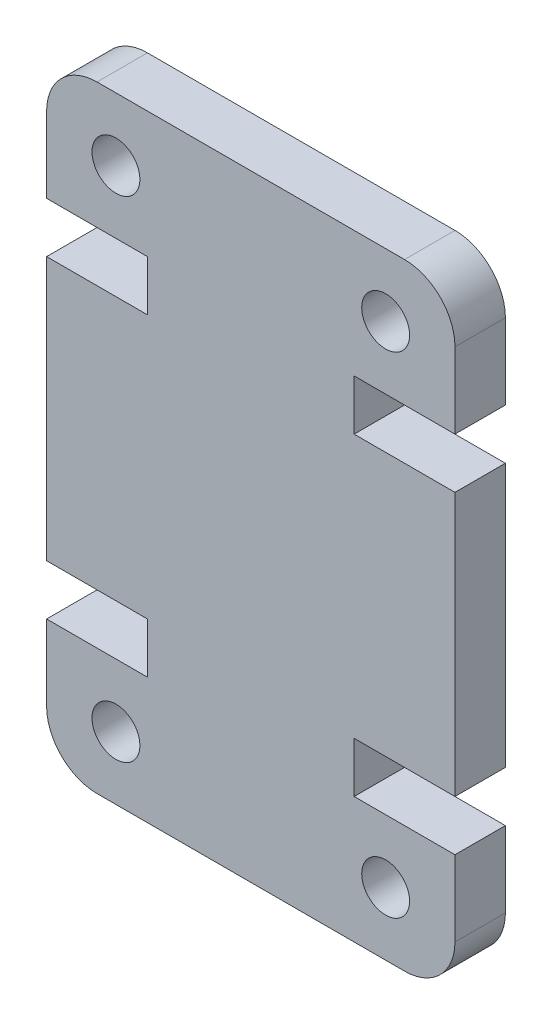
ISO-10303-21;
HEADER;
FILE_DESCRIPTION(('STEP AP214'),'2;1');
FILE_NAME('part.step','',(''),(''),'','','');
FILE_SCHEMA(('AUTOMOTIVE_DESIGN { 1 0 10303 214 1 1 1 1 }'));
ENDSEC;
DATA;
#1=APPLICATION_CONTEXT('core data for automotive mechanical design processes');
#2=APPLICATION_PROTOCOL_DEFINITION('international standard','automotive_design',2000,#1);
#3=PRODUCT_CONTEXT('',#1,'mechanical');
#4=PRODUCT('Part','Part','',(#3));
#5=PRODUCT_RELATED_PRODUCT_CATEGORY('part','',(#4));
#6=PRODUCT_DEFINITION_FORMATION('','',#4);
#7=PRODUCT_DEFINITION_CONTEXT('part definition',#1,'design');
#8=PRODUCT_DEFINITION('design','',#6,#7);
#9=PRODUCT_DEFINITION_SHAPE('','',#8);
#10=(LENGTH_UNIT() NAMED_UNIT(*) SI_UNIT(.MILLI.,.METRE.));
#11=(NAMED_UNIT(*) PLANE_ANGLE_UNIT() SI_UNIT($,.RADIAN.));
#12=(NAMED_UNIT(*) SI_UNIT($,.STERADIAN.) SOLID_ANGLE_UNIT());
#13=UNCERTAINTY_MEASURE_WITH_UNIT(LENGTH_MEASURE(1.E-05),#10,'distance_accuracy_value','');
#14=(GEOMETRIC_REPRESENTATION_CONTEXT(3) GLOBAL_UNCERTAINTY_ASSIGNED_CONTEXT((#13)) GLOBAL_UNIT_ASSIGNED_CONTEXT((#10,
#11,#12)) REPRESENTATION_CONTEXT('',''));
#15=CARTESIAN_POINT('',(0.,0.,0.));
#16=DIRECTION('',(0.,0.,1.));
#17=DIRECTION('',(1.,0.,0.));
#18=AXIS2_PLACEMENT_3D('',#15,#16,#17);
#19=CARTESIAN_POINT('',(14.2,2.,4.));
#20=DIRECTION('',(0.,0.,-1.));
#21=DIRECTION('',(-1.,0.,0.));
#22=AXIS2_PLACEMENT_3D('',#19,#20,#21);
#23=CYLINDRICAL_SURFACE('',#22,2.);
#24=CARTESIAN_POINT('',(14.2,2.,2.));
#25=DIRECTION('',(0.,0.,-1.));
#26=DIRECTION('',(-1.,0.,0.));
#27=AXIS2_PLACEMENT_3D('',#24,#25,#26);
#28=CIRCLE('',#27,2.);
#29=CARTESIAN_POINT('',(16.2,2.00000000000001,2.));
#30=VERTEX_POINT('',#29);
#31=CARTESIAN_POINT('',(14.2,0.,2.));
#32=VERTEX_POINT('',#31);
#33=EDGE_CURVE('E48',#30,#32,#28,.T.);
#34=ORIENTED_EDGE('',*,*,#33,.F.);
#35=DIRECTION('',(0.,0.,-1.));
#36=VECTOR('',#35,1.);
#37=CARTESIAN_POINT('',(16.2,2.,4.));
#38=LINE('',#37,#36);
#39=CARTESIAN_POINT('',(16.2,2.,4.));
#40=VERTEX_POINT('',#39);
#41=EDGE_CURVE('E11',#40,#30,#38,.T.);
#42=ORIENTED_EDGE('',*,*,#41,.F.);
#43=CARTESIAN_POINT('',(14.2,2.,4.));
#44=DIRECTION('',(0.,0.,1.));
#45=DIRECTION('',(-1.,0.,0.));
#46=AXIS2_PLACEMENT_3D('',#43,#44,#45);
#47=CIRCLE('',#46,2.);
#48=CARTESIAN_POINT('',(14.2,0.,4.));
#49=VERTEX_POINT('',#48);
#50=EDGE_CURVE('E353',#49,#40,#47,.T.);
#51=ORIENTED_EDGE('',*,*,#50,.F.);
#52=DIRECTION('',(0.,0.,-1.));
#53=VECTOR('',#52,1.);
#54=CARTESIAN_POINT('',(14.2,0.,4.));
#55=LINE('',#54,#53);
#56=EDGE_CURVE('E214',#49,#32,#55,.T.);
#57=ORIENTED_EDGE('',*,*,#56,.T.);
#58=EDGE_LOOP('',(#34,#42,#51,#57));
#59=FACE_BOUND('',#58,.T.);
#60=ADVANCED_FACE('F33',(#59),#23,.T.);
#61=CARTESIAN_POINT('',(16.2,5.00000000000014,4.));
#62=DIRECTION('',(-1.,0.,0.));
#63=DIRECTION('',(0.,0.,1.));
#64=AXIS2_PLACEMENT_3D('',#61,#62,#63);
#65=PLANE('',#64);
#66=DIRECTION('',(0.,-1.,0.));
#67=VECTOR('',#66,1.);
#68=CARTESIAN_POINT('',(16.2,24.45,2.));
#69=LINE('',#68,#67);
#70=CARTESIAN_POINT('',(16.2,5.00000000000014,2.));
#71=VERTEX_POINT('',#70);
#72=EDGE_CURVE('E290',#71,#30,#69,.T.);
#73=ORIENTED_EDGE('',*,*,#72,.F.);
#74=DIRECTION('',(0.,0.,-1.));
#75=VECTOR('',#74,1.);
#76=CARTESIAN_POINT('',(16.2,5.00000000000014,4.));
#77=LINE('',#76,#75);
#78=CARTESIAN_POINT('',(16.2,5.00000000000014,4.));
#79=VERTEX_POINT('',#78);
#80=EDGE_CURVE('E41',#79,#71,#77,.T.);
#81=ORIENTED_EDGE('',*,*,#80,.F.);
#82=DIRECTION('',(0.,1.,0.));
#83=VECTOR('',#82,1.);
#84=CARTESIAN_POINT('',(16.2,5.00000000000014,4.));
#85=LINE('',#84,#83);
#86=EDGE_CURVE('E289',#40,#79,#85,.T.);
#87=ORIENTED_EDGE('',*,*,#86,.F.);
#88=ORIENTED_EDGE('',*,*,#41,.T.);
#89=EDGE_LOOP('',(#73,#81,#87,#88));
#90=FACE_BOUND('',#89,.T.);
#91=ADVANCED_FACE('F288',(#90),#65,.F.);
#92=CARTESIAN_POINT('',(12.2,5.00000000000014,4.));
#93=DIRECTION('',(0.,-1.,0.));
#94=DIRECTION('',(0.,0.,-1.));
#95=AXIS2_PLACEMENT_3D('',#92,#93,#94);
#96=PLANE('',#95);
#97=DIRECTION('',(1.,0.,0.));
#98=VECTOR('',#97,1.);
#99=CARTESIAN_POINT('',(12.2,5.00000000000014,2.));
#100=LINE('',#99,#98);
#101=CARTESIAN_POINT('',(12.2,5.00000000000014,2.));
#102=VERTEX_POINT('',#101);
#103=EDGE_CURVE('E284',#102,#71,#100,.T.);
#104=ORIENTED_EDGE('',*,*,#103,.F.);
#105=DIRECTION('',(0.,0.,-1.));
#106=VECTOR('',#105,1.);
#107=CARTESIAN_POINT('',(12.2,5.00000000000014,4.));
#108=LINE('',#107,#106);
#109=CARTESIAN_POINT('',(12.2,5.00000000000014,4.));
#110=VERTEX_POINT('',#109);
#111=EDGE_CURVE('E274',#110,#102,#108,.T.);
#112=ORIENTED_EDGE('',*,*,#111,.F.);
#113=DIRECTION('',(-1.,0.,0.));
#114=VECTOR('',#113,1.);
#115=CARTESIAN_POINT('',(12.2,5.00000000000014,4.));
#116=LINE('',#115,#114);
#117=EDGE_CURVE('E285',#79,#110,#116,.T.);
#118=ORIENTED_EDGE('',*,*,#117,.F.);
#119=ORIENTED_EDGE('',*,*,#80,.T.);
#120=EDGE_LOOP('',(#104,#112,#118,#119));
#121=FACE_BOUND('',#120,.T.);
#122=ADVANCED_FACE('F282',(#121),#96,.F.);
#123=CARTESIAN_POINT('',(12.2,7.00000000000014,4.));
#124=DIRECTION('',(-1.,0.,0.));
#125=DIRECTION('',(0.,0.,1.));
#126=AXIS2_PLACEMENT_3D('',#123,#124,#125);
#127=PLANE('',#126);
#128=DIRECTION('',(0.,-1.,0.));
#129=VECTOR('',#128,1.);
#130=CARTESIAN_POINT('',(12.2,7.00000000000014,2.));
#131=LINE('',#130,#129);
#132=CARTESIAN_POINT('',(12.2,7.00000000000014,2.));
#133=VERTEX_POINT('',#132);
#134=EDGE_CURVE('E337',#133,#102,#131,.T.);
#135=ORIENTED_EDGE('',*,*,#134,.F.);
#136=DIRECTION('',(0.,0.,-1.));
#137=VECTOR('',#136,1.);
#138=CARTESIAN_POINT('',(12.2,7.00000000000014,4.));
#139=LINE('',#138,#137);
#140=CARTESIAN_POINT('',(12.2,7.00000000000014,4.));
#141=VERTEX_POINT('',#140);
#142=EDGE_CURVE('E271',#141,#133,#139,.T.);
#143=ORIENTED_EDGE('',*,*,#142,.F.);
#144=DIRECTION('',(0.,1.,0.));
#145=VECTOR('',#144,1.);
#146=CARTESIAN_POINT('',(12.2,7.00000000000014,4.));
#147=LINE('',#146,#145);
#148=EDGE_CURVE('E357',#110,#141,#147,.T.);
#149=ORIENTED_EDGE('',*,*,#148,.F.);
#150=ORIENTED_EDGE('',*,*,#111,.T.);
#151=EDGE_LOOP('',(#135,#143,#149,#150));
#152=FACE_BOUND('',#151,.T.);
#153=ADVANCED_FACE('F460',(#152),#127,.F.);
#154=CARTESIAN_POINT('',(16.2,7.00000000000014,4.));
#155=DIRECTION('',(0.,1.,0.));
#156=DIRECTION('',(-1.,0.,0.));
#157=AXIS2_PLACEMENT_3D('',#154,#155,#156);
#158=PLANE('',#157);
#159=DIRECTION('',(-1.,0.,0.));
#160=VECTOR('',#159,1.);
#161=CARTESIAN_POINT('',(16.2,7.00000000000014,2.));
#162=LINE('',#161,#160);
#163=CARTESIAN_POINT('',(16.2,7.00000000000014,2.));
#164=VERTEX_POINT('',#163);
#165=EDGE_CURVE('E335',#164,#133,#162,.T.);
#166=ORIENTED_EDGE('',*,*,#165,.F.);
#167=DIRECTION('',(0.,0.,-1.));
#168=VECTOR('',#167,1.);
#169=CARTESIAN_POINT('',(16.2,7.00000000000014,4.));
#170=LINE('',#169,#168);
#171=CARTESIAN_POINT('',(16.2,7.00000000000014,4.));
#172=VERTEX_POINT('',#171);
#173=EDGE_CURVE('E268',#172,#164,#170,.T.);
#174=ORIENTED_EDGE('',*,*,#173,.F.);
#175=DIRECTION('',(1.,0.,0.));
#176=VECTOR('',#175,1.);
#177=CARTESIAN_POINT('',(16.2,7.00000000000014,4.));
#178=LINE('',#177,#176);
#179=EDGE_CURVE('E359',#141,#172,#178,.T.);
#180=ORIENTED_EDGE('',*,*,#179,.F.);
#181=ORIENTED_EDGE('',*,*,#142,.T.);
#182=EDGE_LOOP('',(#166,#174,#180,#181));
#183=FACE_BOUND('',#182,.T.);
#184=ADVANCED_FACE('F456',(#183),#158,.F.);
#185=CARTESIAN_POINT('',(16.2,17.4499999999999,4.));
#186=DIRECTION('',(-1.,0.,0.));
#187=DIRECTION('',(0.,0.,1.));
#188=AXIS2_PLACEMENT_3D('',#185,#186,#187);
#189=PLANE('',#188);
#190=CARTESIAN_POINT('',(16.2,17.4499999999999,2.));
#191=VERTEX_POINT('',#190);
#192=EDGE_CURVE('E292',#191,#164,#69,.T.);
#193=ORIENTED_EDGE('',*,*,#192,.F.);
#194=DIRECTION('',(0.,0.,-1.));
#195=VECTOR('',#194,1.);
#196=CARTESIAN_POINT('',(16.2,17.4499999999999,4.));
#197=LINE('',#196,#195);
#198=CARTESIAN_POINT('',(16.2,17.4499999999999,4.));
#199=VERTEX_POINT('',#198);
#200=EDGE_CURVE('E265',#199,#191,#197,.T.);
#201=ORIENTED_EDGE('',*,*,#200,.F.);
#202=DIRECTION('',(0.,1.,0.));
#203=VECTOR('',#202,1.);
#204=CARTESIAN_POINT('',(16.2,17.4499999999999,4.));
#205=LINE('',#204,#203);
#206=EDGE_CURVE('E361',#172,#199,#205,.T.);
#207=ORIENTED_EDGE('',*,*,#206,.F.);
#208=ORIENTED_EDGE('',*,*,#173,.T.);
#209=EDGE_LOOP('',(#193,#201,#207,#208));
#210=FACE_BOUND('',#209,.T.);
#211=ADVANCED_FACE('F451',(#210),#189,.F.);
#212=CARTESIAN_POINT('',(16.2,17.4499999999999,4.));
#213=DIRECTION('',(0.,-1.,0.));
#214=DIRECTION('',(1.,0.,0.));
#215=AXIS2_PLACEMENT_3D('',#212,#213,#214);
#216=PLANE('',#215);
#217=DIRECTION('',(1.,0.,0.));
#218=VECTOR('',#217,1.);
#219=CARTESIAN_POINT('',(16.2,17.4499999999999,2.));
#220=LINE('',#219,#218);
#221=CARTESIAN_POINT('',(12.2,17.4499999999999,2.));
#222=VERTEX_POINT('',#221);
#223=EDGE_CURVE('E333',#222,#191,#220,.T.);
#224=ORIENTED_EDGE('',*,*,#223,.F.);
#225=DIRECTION('',(0.,0.,-1.));
#226=VECTOR('',#225,1.);
#227=CARTESIAN_POINT('',(12.2,17.4499999999999,4.));
#228=LINE('',#227,#226);
#229=CARTESIAN_POINT('',(12.2,17.4499999999999,4.));
#230=VERTEX_POINT('',#229);
#231=EDGE_CURVE('E262',#230,#222,#228,.T.);
#232=ORIENTED_EDGE('',*,*,#231,.F.);
#233=DIRECTION('',(-1.,0.,0.));
#234=VECTOR('',#233,1.);
#235=CARTESIAN_POINT('',(16.2,17.4499999999999,4.));
#236=LINE('',#235,#234);
#237=EDGE_CURVE('E363',#199,#230,#236,.T.);
#238=ORIENTED_EDGE('',*,*,#237,.F.);
#239=ORIENTED_EDGE('',*,*,#200,.T.);
#240=EDGE_LOOP('',(#224,#232,#238,#239));
#241=FACE_BOUND('',#240,.T.);
#242=ADVANCED_FACE('F446',(#241),#216,.F.);
#243=CARTESIAN_POINT('',(12.2,17.4499999999999,4.));
#244=DIRECTION('',(-1.,0.,0.));
#245=DIRECTION('',(0.,0.,1.));
#246=AXIS2_PLACEMENT_3D('',#243,#244,#245);
#247=PLANE('',#246);
#248=DIRECTION('',(0.,-1.,0.));
#249=VECTOR('',#248,1.);
#250=CARTESIAN_POINT('',(12.2,17.4499999999999,2.));
#251=LINE('',#250,#249);
#252=CARTESIAN_POINT('',(12.2,19.4499999999999,2.));
#253=VERTEX_POINT('',#252);
#254=EDGE_CURVE('E331',#253,#222,#251,.T.);
#255=ORIENTED_EDGE('',*,*,#254,.F.);
#256=DIRECTION('',(0.,0.,-1.));
#257=VECTOR('',#256,1.);
#258=CARTESIAN_POINT('',(12.2,19.4499999999999,4.));
#259=LINE('',#258,#257);
#260=CARTESIAN_POINT('',(12.2,19.4499999999999,4.));
#261=VERTEX_POINT('',#260);
#262=EDGE_CURVE('E259',#261,#253,#259,.T.);
#263=ORIENTED_EDGE('',*,*,#262,.F.);
#264=DIRECTION('',(0.,1.,0.));
#265=VECTOR('',#264,1.);
#266=CARTESIAN_POINT('',(12.2,17.4499999999999,4.));
#267=LINE('',#266,#265);
#268=EDGE_CURVE('E365',#230,#261,#267,.T.);
#269=ORIENTED_EDGE('',*,*,#268,.F.);
#270=ORIENTED_EDGE('',*,*,#231,.T.);
#271=EDGE_LOOP('',(#255,#263,#269,#270));
#272=FACE_BOUND('',#271,.T.);
#273=ADVANCED_FACE('F441',(#272),#247,.F.);
#274=CARTESIAN_POINT('',(12.2,19.4499999999999,4.));
#275=DIRECTION('',(0.,1.,0.));
#276=DIRECTION('',(0.,0.,1.));
#277=AXIS2_PLACEMENT_3D('',#274,#275,#276);
#278=PLANE('',#277);
#279=DIRECTION('',(-1.,0.,0.));
#280=VECTOR('',#279,1.);
#281=CARTESIAN_POINT('',(12.2,19.4499999999999,2.));
#282=LINE('',#281,#280);
#283=CARTESIAN_POINT('',(16.2,19.4499999999999,2.));
#284=VERTEX_POINT('',#283);
#285=EDGE_CURVE('E329',#284,#253,#282,.T.);
#286=ORIENTED_EDGE('',*,*,#285,.F.);
#287=DIRECTION('',(0.,0.,-1.));
#288=VECTOR('',#287,1.);
#289=CARTESIAN_POINT('',(16.2,19.4499999999999,4.));
#290=LINE('',#289,#288);
#291=CARTESIAN_POINT('',(16.2,19.4499999999999,4.));
#292=VERTEX_POINT('',#291);
#293=EDGE_CURVE('E256',#292,#284,#290,.T.);
#294=ORIENTED_EDGE('',*,*,#293,.F.);
#295=DIRECTION('',(1.,0.,0.));
#296=VECTOR('',#295,1.);
#297=CARTESIAN_POINT('',(12.2,19.4499999999999,4.));
#298=LINE('',#297,#296);
#299=EDGE_CURVE('E367',#261,#292,#298,.T.);
#300=ORIENTED_EDGE('',*,*,#299,.F.);
#301=ORIENTED_EDGE('',*,*,#262,.T.);
#302=EDGE_LOOP('',(#286,#294,#300,#301));
#303=FACE_BOUND('',#302,.T.);
#304=ADVANCED_FACE('F436',(#303),#278,.F.);
#305=CARTESIAN_POINT('',(16.2,19.4499999999999,4.));
#306=DIRECTION('',(-1.,0.,0.));
#307=DIRECTION('',(0.,0.,1.));
#308=AXIS2_PLACEMENT_3D('',#305,#306,#307);
#309=PLANE('',#308);
#310=CARTESIAN_POINT('',(16.2,22.45,2.));
#311=VERTEX_POINT('',#310);
#312=EDGE_CURVE('E295',#311,#284,#69,.T.);
#313=ORIENTED_EDGE('',*,*,#312,.F.);
#314=DIRECTION('',(0.,0.,-1.));
#315=VECTOR('',#314,1.);
#316=CARTESIAN_POINT('',(16.2,22.45,4.));
#317=LINE('',#316,#315);
#318=CARTESIAN_POINT('',(16.2,22.45,4.));
#319=VERTEX_POINT('',#318);
#320=EDGE_CURVE('E253',#319,#311,#317,.T.);
#321=ORIENTED_EDGE('',*,*,#320,.F.);
#322=DIRECTION('',(0.,1.,0.));
#323=VECTOR('',#322,1.);
#324=CARTESIAN_POINT('',(16.2,19.4499999999999,4.));
#325=LINE('',#324,#323);
#326=EDGE_CURVE('E369',#292,#319,#325,.T.);
#327=ORIENTED_EDGE('',*,*,#326,.F.);
#328=ORIENTED_EDGE('',*,*,#293,.T.);
#329=EDGE_LOOP('',(#313,#321,#327,#328));
#330=FACE_BOUND('',#329,.T.);
#331=ADVANCED_FACE('F432',(#330),#309,.F.);
#332=CARTESIAN_POINT('',(14.2,22.45,4.));
#333=DIRECTION('',(0.,0.,-1.));
#334=DIRECTION('',(-1.,0.,0.));
#335=AXIS2_PLACEMENT_3D('',#332,#333,#334);
#336=CYLINDRICAL_SURFACE('',#335,2.);
#337=CARTESIAN_POINT('',(14.2,22.45,2.));
#338=DIRECTION('',(0.,0.,-1.));
#339=DIRECTION('',(-1.,0.,0.));
#340=AXIS2_PLACEMENT_3D('',#337,#338,#339);
#341=CIRCLE('',#340,2.);
#342=CARTESIAN_POINT('',(14.2,24.45,2.));
#343=VERTEX_POINT('',#342);
#344=EDGE_CURVE('E327',#343,#311,#341,.T.);
#345=ORIENTED_EDGE('',*,*,#344,.F.);
#346=DIRECTION('',(0.,0.,-1.));
#347=VECTOR('',#346,1.);
#348=CARTESIAN_POINT('',(14.2,24.45,4.));
#349=LINE('',#348,#347);
#350=CARTESIAN_POINT('',(14.2,24.45,4.));
#351=VERTEX_POINT('',#350);
#352=EDGE_CURVE('E250',#351,#343,#349,.T.);
#353=ORIENTED_EDGE('',*,*,#352,.F.);
#354=CARTESIAN_POINT('',(14.2,22.45,4.));
#355=DIRECTION('',(0.,0.,1.));
#356=DIRECTION('',(1.,0.,0.));
#357=AXIS2_PLACEMENT_3D('',#354,#355,#356);
#358=CIRCLE('',#357,2.);
#359=EDGE_CURVE('E371',#319,#351,#358,.T.);
#360=ORIENTED_EDGE('',*,*,#359,.F.);
#361=ORIENTED_EDGE('',*,*,#320,.T.);
#362=EDGE_LOOP('',(#345,#353,#360,#361));
#363=FACE_BOUND('',#362,.T.);
#364=ADVANCED_FACE('F428',(#363),#336,.T.);
#365=CARTESIAN_POINT('',(1.99999999999999,24.45,4.));
#366=DIRECTION('',(0.,-1.,0.));
#367=DIRECTION('',(0.,0.,-1.));
#368=AXIS2_PLACEMENT_3D('',#365,#366,#367);
#369=PLANE('',#368);
#370=DIRECTION('',(1.,0.,0.));
#371=VECTOR('',#370,1.);
#372=CARTESIAN_POINT('',(0.,24.45,2.));
#373=LINE('',#372,#371);
#374=CARTESIAN_POINT('',(2.,24.45,2.));
#375=VERTEX_POINT('',#374);
#376=EDGE_CURVE('E293',#375,#343,#373,.T.);
#377=ORIENTED_EDGE('',*,*,#376,.F.);
#378=DIRECTION('',(0.,0.,-1.));
#379=VECTOR('',#378,1.);
#380=CARTESIAN_POINT('',(1.99999999999999,24.45,4.));
#381=LINE('',#380,#379);
#382=CARTESIAN_POINT('',(1.99999999999999,24.45,4.));
#383=VERTEX_POINT('',#382);
#384=EDGE_CURVE('E247',#383,#375,#381,.T.);
#385=ORIENTED_EDGE('',*,*,#384,.F.);
#386=DIRECTION('',(-1.,0.,0.));
#387=VECTOR('',#386,1.);
#388=CARTESIAN_POINT('',(1.99999999999999,24.45,4.));
#389=LINE('',#388,#387);
#390=EDGE_CURVE('E373',#351,#383,#389,.T.);
#391=ORIENTED_EDGE('',*,*,#390,.F.);
#392=ORIENTED_EDGE('',*,*,#352,.T.);
#393=EDGE_LOOP('',(#377,#385,#391,#392));
#394=FACE_BOUND('',#393,.T.);
#395=ADVANCED_FACE('F425',(#394),#369,.F.);
#396=CARTESIAN_POINT('',(2.,22.45,4.));
#397=DIRECTION('',(0.,0.,-1.));
#398=DIRECTION('',(-1.,0.,0.));
#399=AXIS2_PLACEMENT_3D('',#396,#397,#398);
#400=CYLINDRICAL_SURFACE('',#399,2.);
#401=CARTESIAN_POINT('',(2.,22.45,2.));
#402=DIRECTION('',(0.,0.,-1.));
#403=DIRECTION('',(-1.,0.,0.));
#404=AXIS2_PLACEMENT_3D('',#401,#402,#403);
#405=CIRCLE('',#404,2.);
#406=CARTESIAN_POINT('',(0.,22.45,2.));
#407=VERTEX_POINT('',#406);
#408=EDGE_CURVE('E325',#407,#375,#405,.T.);
#409=ORIENTED_EDGE('',*,*,#408,.F.);
#410=DIRECTION('',(0.,0.,-1.));
#411=VECTOR('',#410,1.);
#412=CARTESIAN_POINT('',(0.,22.45,4.));
#413=LINE('',#412,#411);
#414=CARTESIAN_POINT('',(0.,22.45,4.));
#415=VERTEX_POINT('',#414);
#416=EDGE_CURVE('E244',#415,#407,#413,.T.);
#417=ORIENTED_EDGE('',*,*,#416,.F.);
#418=CARTESIAN_POINT('',(2.,22.45,4.));
#419=DIRECTION('',(0.,0.,1.));
#420=DIRECTION('',(-1.,0.,0.));
#421=AXIS2_PLACEMENT_3D('',#418,#419,#420);
#422=CIRCLE('',#421,2.);
#423=EDGE_CURVE('E375',#383,#415,#422,.T.);
#424=ORIENTED_EDGE('',*,*,#423,.F.);
#425=ORIENTED_EDGE('',*,*,#384,.T.);
#426=EDGE_LOOP('',(#409,#417,#424,#425));
#427=FACE_BOUND('',#426,.T.);
#428=ADVANCED_FACE('F414',(#427),#400,.T.);
#429=CARTESIAN_POINT('',(0.,19.4499999999999,4.));
#430=DIRECTION('',(1.,0.,0.));
#431=DIRECTION('',(0.,1.,0.));
#432=AXIS2_PLACEMENT_3D('',#429,#430,#431);
#433=PLANE('',#432);
#434=DIRECTION('',(0.,1.,0.));
#435=VECTOR('',#434,1.);
#436=CARTESIAN_POINT('',(0.,0.,2.));
#437=LINE('',#436,#435);
#438=CARTESIAN_POINT('',(0.,19.4499999999999,2.));
#439=VERTEX_POINT('',#438);
#440=EDGE_CURVE('E200',#439,#407,#437,.T.);
#441=ORIENTED_EDGE('',*,*,#440,.F.);
#442=DIRECTION('',(0.,0.,-1.));
#443=VECTOR('',#442,1.);
#444=CARTESIAN_POINT('',(0.,19.4499999999999,4.));
#445=LINE('',#444,#443);
#446=CARTESIAN_POINT('',(0.,19.4499999999999,4.));
#447=VERTEX_POINT('',#446);
#448=EDGE_CURVE('E241',#447,#439,#445,.T.);
#449=ORIENTED_EDGE('',*,*,#448,.F.);
#450=DIRECTION('',(0.,-1.,0.));
#451=VECTOR('',#450,1.);
#452=CARTESIAN_POINT('',(0.,19.4499999999999,4.));
#453=LINE('',#452,#451);
#454=EDGE_CURVE('E377',#415,#447,#453,.T.);
#455=ORIENTED_EDGE('',*,*,#454,.F.);
#456=ORIENTED_EDGE('',*,*,#416,.T.);
#457=EDGE_LOOP('',(#441,#449,#455,#456));
#458=FACE_BOUND('',#457,.T.);
#459=ADVANCED_FACE('F418',(#458),#433,.F.);
#460=CARTESIAN_POINT('',(3.99999999999999,19.4499999999999,4.));
#461=DIRECTION('',(0.,1.,0.));
#462=DIRECTION('',(-1.,0.,0.));
#463=AXIS2_PLACEMENT_3D('',#460,#461,#462);
#464=PLANE('',#463);
#465=DIRECTION('',(-1.,0.,0.));
#466=VECTOR('',#465,1.);
#467=CARTESIAN_POINT('',(3.99999999999999,19.4499999999999,2.));
#468=LINE('',#467,#466);
#469=CARTESIAN_POINT('',(3.99999999999999,19.4499999999999,2.));
#470=VERTEX_POINT('',#469);
#471=EDGE_CURVE('E323',#470,#439,#468,.T.);
#472=ORIENTED_EDGE('',*,*,#471,.F.);
#473=DIRECTION('',(0.,0.,-1.));
#474=VECTOR('',#473,1.);
#475=CARTESIAN_POINT('',(3.99999999999999,19.4499999999999,4.));
#476=LINE('',#475,#474);
#477=CARTESIAN_POINT('',(3.99999999999999,19.4499999999999,4.));
#478=VERTEX_POINT('',#477);
#479=EDGE_CURVE('E238',#478,#470,#476,.T.);
#480=ORIENTED_EDGE('',*,*,#479,.F.);
#481=DIRECTION('',(1.,0.,0.));
#482=VECTOR('',#481,1.);
#483=CARTESIAN_POINT('',(3.99999999999999,19.4499999999999,4.));
#484=LINE('',#483,#482);
#485=EDGE_CURVE('E379',#447,#478,#484,.T.);
#486=ORIENTED_EDGE('',*,*,#485,.F.);
#487=ORIENTED_EDGE('',*,*,#448,.T.);
#488=EDGE_LOOP('',(#472,#480,#486,#487));
#489=FACE_BOUND('',#488,.T.);
#490=ADVANCED_FACE('F495',(#489),#464,.F.);
#491=CARTESIAN_POINT('',(3.99999999999999,17.4499999999999,4.));
#492=DIRECTION('',(1.,0.,0.));
#493=DIRECTION('',(0.,0.,-1.));
#494=AXIS2_PLACEMENT_3D('',#491,#492,#493);
#495=PLANE('',#494);
#496=DIRECTION('',(0.,1.,0.));
#497=VECTOR('',#496,1.);
#498=CARTESIAN_POINT('',(3.99999999999999,17.4499999999999,2.));
#499=LINE('',#498,#497);
#500=CARTESIAN_POINT('',(3.99999999999999,17.4499999999999,2.));
#501=VERTEX_POINT('',#500);
#502=EDGE_CURVE('E321',#501,#470,#499,.T.);
#503=ORIENTED_EDGE('',*,*,#502,.F.);
#504=DIRECTION('',(0.,0.,-1.));
#505=VECTOR('',#504,1.);
#506=CARTESIAN_POINT('',(3.99999999999999,17.4499999999999,4.));
#507=LINE('',#506,#505);
#508=CARTESIAN_POINT('',(3.99999999999999,17.4499999999999,4.));
#509=VERTEX_POINT('',#508);
#510=EDGE_CURVE('E235',#509,#501,#507,.T.);
#511=ORIENTED_EDGE('',*,*,#510,.F.);
#512=DIRECTION('',(0.,-1.,0.));
#513=VECTOR('',#512,1.);
#514=CARTESIAN_POINT('',(3.99999999999999,17.4499999999999,4.));
#515=LINE('',#514,#513);
#516=EDGE_CURVE('E381',#478,#509,#515,.T.);
#517=ORIENTED_EDGE('',*,*,#516,.F.);
#518=ORIENTED_EDGE('',*,*,#479,.T.);
#519=EDGE_LOOP('',(#503,#511,#517,#518));
#520=FACE_BOUND('',#519,.T.);
#521=ADVANCED_FACE('F498',(#520),#495,.F.);
#522=CARTESIAN_POINT('',(0.,17.4499999999999,4.));
#523=DIRECTION('',(0.,-1.,0.));
#524=DIRECTION('',(1.,0.,0.));
#525=AXIS2_PLACEMENT_3D('',#522,#523,#524);
#526=PLANE('',#525);
#527=DIRECTION('',(1.,0.,0.));
#528=VECTOR('',#527,1.);
#529=CARTESIAN_POINT('',(0.,17.4499999999999,2.));
#530=LINE('',#529,#528);
#531=CARTESIAN_POINT('',(0.,17.4499999999999,2.));
#532=VERTEX_POINT('',#531);
#533=EDGE_CURVE('E319',#532,#501,#530,.T.);
#534=ORIENTED_EDGE('',*,*,#533,.F.);
#535=DIRECTION('',(0.,0.,-1.));
#536=VECTOR('',#535,1.);
#537=CARTESIAN_POINT('',(0.,17.4499999999999,4.));
#538=LINE('',#537,#536);
#539=CARTESIAN_POINT('',(0.,17.4499999999999,4.));
#540=VERTEX_POINT('',#539);
#541=EDGE_CURVE('E232',#540,#532,#538,.T.);
#542=ORIENTED_EDGE('',*,*,#541,.F.);
#543=DIRECTION('',(-1.,0.,0.));
#544=VECTOR('',#543,1.);
#545=CARTESIAN_POINT('',(0.,17.4499999999999,4.));
#546=LINE('',#545,#544);
#547=EDGE_CURVE('E383',#509,#540,#546,.T.);
#548=ORIENTED_EDGE('',*,*,#547,.F.);
#549=ORIENTED_EDGE('',*,*,#510,.T.);
#550=EDGE_LOOP('',(#534,#542,#548,#549));
#551=FACE_BOUND('',#550,.T.);
#552=ADVANCED_FACE('F502',(#551),#526,.F.);
#553=CARTESIAN_POINT('',(0.,17.4499999999999,4.));
#554=DIRECTION('',(1.,0.,0.));
#555=DIRECTION('',(0.,0.,-1.));
#556=AXIS2_PLACEMENT_3D('',#553,#554,#555);
#557=PLANE('',#556);
#558=CARTESIAN_POINT('',(0.,7.00000000000013,2.));
#559=VERTEX_POINT('',#558);
#560=EDGE_CURVE('E404',#559,#532,#437,.T.);
#561=ORIENTED_EDGE('',*,*,#560,.F.);
#562=DIRECTION('',(0.,0.,-1.));
#563=VECTOR('',#562,1.);
#564=CARTESIAN_POINT('',(0.,7.00000000000012,4.));
#565=LINE('',#564,#563);
#566=CARTESIAN_POINT('',(0.,7.00000000000012,4.));
#567=VERTEX_POINT('',#566);
#568=EDGE_CURVE('E229',#567,#559,#565,.T.);
#569=ORIENTED_EDGE('',*,*,#568,.F.);
#570=DIRECTION('',(0.,-1.,0.));
#571=VECTOR('',#570,1.);
#572=CARTESIAN_POINT('',(0.,17.4499999999999,4.));
#573=LINE('',#572,#571);
#574=EDGE_CURVE('E385',#540,#567,#573,.T.);
#575=ORIENTED_EDGE('',*,*,#574,.F.);
#576=ORIENTED_EDGE('',*,*,#541,.T.);
#577=EDGE_LOOP('',(#561,#569,#575,#576));
#578=FACE_BOUND('',#577,.T.);
#579=ADVANCED_FACE('F506',(#578),#557,.F.);
#580=CARTESIAN_POINT('',(0.,7.00000000000012,4.));
#581=DIRECTION('',(0.,1.,0.));
#582=DIRECTION('',(-1.,0.,0.));
#583=AXIS2_PLACEMENT_3D('',#580,#581,#582);
#584=PLANE('',#583);
#585=DIRECTION('',(-1.,0.,0.));
#586=VECTOR('',#585,1.);
#587=CARTESIAN_POINT('',(0.,7.00000000000012,2.));
#588=LINE('',#587,#586);
#589=CARTESIAN_POINT('',(4.,7.00000000000014,2.));
#590=VERTEX_POINT('',#589);
#591=EDGE_CURVE('E317',#590,#559,#588,.T.);
#592=ORIENTED_EDGE('',*,*,#591,.F.);
#593=DIRECTION('',(0.,0.,-1.));
#594=VECTOR('',#593,1.);
#595=CARTESIAN_POINT('',(4.,7.00000000000014,4.));
#596=LINE('',#595,#594);
#597=CARTESIAN_POINT('',(4.,7.00000000000014,4.));
#598=VERTEX_POINT('',#597);
#599=EDGE_CURVE('E226',#598,#590,#596,.T.);
#600=ORIENTED_EDGE('',*,*,#599,.F.);
#601=DIRECTION('',(1.,0.,0.));
#602=VECTOR('',#601,1.);
#603=CARTESIAN_POINT('',(0.,7.00000000000012,4.));
#604=LINE('',#603,#602);
#605=EDGE_CURVE('E387',#567,#598,#604,.T.);
#606=ORIENTED_EDGE('',*,*,#605,.F.);
#607=ORIENTED_EDGE('',*,*,#568,.T.);
#608=EDGE_LOOP('',(#592,#600,#606,#607));
#609=FACE_BOUND('',#608,.T.);
#610=ADVANCED_FACE('F510',(#609),#584,.F.);
#611=CARTESIAN_POINT('',(4.,7.00000000000014,4.));
#612=DIRECTION('',(1.,0.,0.));
#613=DIRECTION('',(0.,0.,-1.));
#614=AXIS2_PLACEMENT_3D('',#611,#612,#613);
#615=PLANE('',#614);
#616=DIRECTION('',(0.,1.,0.));
#617=VECTOR('',#616,1.);
#618=CARTESIAN_POINT('',(4.,7.00000000000014,2.));
#619=LINE('',#618,#617);
#620=CARTESIAN_POINT('',(4.,5.00000000000014,2.));
#621=VERTEX_POINT('',#620);
#622=EDGE_CURVE('E315',#621,#590,#619,.T.);
#623=ORIENTED_EDGE('',*,*,#622,.F.);
#624=DIRECTION('',(0.,0.,-1.));
#625=VECTOR('',#624,1.);
#626=CARTESIAN_POINT('',(4.,5.00000000000014,4.));
#627=LINE('',#626,#625);
#628=CARTESIAN_POINT('',(4.,5.00000000000014,4.));
#629=VERTEX_POINT('',#628);
#630=EDGE_CURVE('E223',#629,#621,#627,.T.);
#631=ORIENTED_EDGE('',*,*,#630,.F.);
#632=DIRECTION('',(0.,-1.,0.));
#633=VECTOR('',#632,1.);
#634=CARTESIAN_POINT('',(4.,7.00000000000014,4.));
#635=LINE('',#634,#633);
#636=EDGE_CURVE('E389',#598,#629,#635,.T.);
#637=ORIENTED_EDGE('',*,*,#636,.F.);
#638=ORIENTED_EDGE('',*,*,#599,.T.);
#639=EDGE_LOOP('',(#623,#631,#637,#638));
#640=FACE_BOUND('',#639,.T.);
#641=ADVANCED_FACE('F514',(#640),#615,.F.);
#642=CARTESIAN_POINT('',(4.,5.00000000000014,4.));
#643=DIRECTION('',(0.,-1.,0.));
#644=DIRECTION('',(1.,0.,0.));
#645=AXIS2_PLACEMENT_3D('',#642,#643,#644);
#646=PLANE('',#645);
#647=DIRECTION('',(1.,0.,0.));
#648=VECTOR('',#647,1.);
#649=CARTESIAN_POINT('',(4.,5.00000000000014,2.));
#650=LINE('',#649,#648);
#651=CARTESIAN_POINT('',(0.,5.00000000000014,2.));
#652=VERTEX_POINT('',#651);
#653=EDGE_CURVE('E210',#652,#621,#650,.T.);
#654=ORIENTED_EDGE('',*,*,#653,.F.);
#655=DIRECTION('',(0.,0.,-1.));
#656=VECTOR('',#655,1.);
#657=CARTESIAN_POINT('',(0.,5.00000000000014,4.));
#658=LINE('',#657,#656);
#659=CARTESIAN_POINT('',(0.,5.00000000000014,4.));
#660=VERTEX_POINT('',#659);
#661=EDGE_CURVE('E216',#660,#652,#658,.T.);
#662=ORIENTED_EDGE('',*,*,#661,.F.);
#663=DIRECTION('',(-1.,0.,0.));
#664=VECTOR('',#663,1.);
#665=CARTESIAN_POINT('',(4.,5.00000000000014,4.));
#666=LINE('',#665,#664);
#667=EDGE_CURVE('E391',#629,#660,#666,.T.);
#668=ORIENTED_EDGE('',*,*,#667,.F.);
#669=ORIENTED_EDGE('',*,*,#630,.T.);
#670=EDGE_LOOP('',(#654,#662,#668,#669));
#671=FACE_BOUND('',#670,.T.);
#672=ADVANCED_FACE('F518',(#671),#646,.F.);
#673=CARTESIAN_POINT('',(0.,5.00000000000014,4.));
#674=DIRECTION('',(1.,0.,0.));
#675=DIRECTION('',(0.,0.,-1.));
#676=AXIS2_PLACEMENT_3D('',#673,#674,#675);
#677=PLANE('',#676);
#678=CARTESIAN_POINT('',(0.,2.,2.));
#679=VERTEX_POINT('',#678);
#680=EDGE_CURVE('E296',#679,#652,#437,.T.);
#681=ORIENTED_EDGE('',*,*,#680,.F.);
#682=DIRECTION('',(0.,0.,-1.));
#683=VECTOR('',#682,1.);
#684=CARTESIAN_POINT('',(0.,2.00000000000002,4.));
#685=LINE('',#684,#683);
#686=CARTESIAN_POINT('',(0.,2.00000000000002,4.));
#687=VERTEX_POINT('',#686);
#688=EDGE_CURVE('E209',#687,#679,#685,.T.);
#689=ORIENTED_EDGE('',*,*,#688,.F.);
#690=DIRECTION('',(0.,-1.,0.));
#691=VECTOR('',#690,1.);
#692=CARTESIAN_POINT('',(0.,5.00000000000014,4.));
#693=LINE('',#692,#691);
#694=EDGE_CURVE('E393',#660,#687,#693,.T.);
#695=ORIENTED_EDGE('',*,*,#694,.F.);
#696=ORIENTED_EDGE('',*,*,#661,.T.);
#697=EDGE_LOOP('',(#681,#689,#695,#696));
#698=FACE_BOUND('',#697,.T.);
#699=ADVANCED_FACE('F402',(#698),#677,.F.);
#700=CARTESIAN_POINT('',(2.,2.,4.));
#701=DIRECTION('',(0.,0.,-1.));
#702=DIRECTION('',(-1.,0.,0.));
#703=AXIS2_PLACEMENT_3D('',#700,#701,#702);
#704=CYLINDRICAL_SURFACE('',#703,2.);
#705=CARTESIAN_POINT('',(2.,2.,2.));
#706=DIRECTION('',(0.,0.,-1.));
#707=DIRECTION('',(-1.,0.,0.));
#708=AXIS2_PLACEMENT_3D('',#705,#706,#707);
#709=CIRCLE('',#708,2.);
#710=CARTESIAN_POINT('',(2.,0.,2.));
#711=VERTEX_POINT('',#710);
#712=EDGE_CURVE('E195',#711,#679,#709,.T.);
#713=ORIENTED_EDGE('',*,*,#712,.F.);
#714=DIRECTION('',(0.,0.,-1.));
#715=VECTOR('',#714,1.);
#716=CARTESIAN_POINT('',(2.,0.,4.));
#717=LINE('',#716,#715);
#718=CARTESIAN_POINT('',(2.,0.,4.));
#719=VERTEX_POINT('',#718);
#720=EDGE_CURVE('E207',#719,#711,#717,.T.);
#721=ORIENTED_EDGE('',*,*,#720,.F.);
#722=CARTESIAN_POINT('',(2.,2.,4.));
#723=DIRECTION('',(0.,0.,1.));
#724=DIRECTION('',(1.,0.,0.));
#725=AXIS2_PLACEMENT_3D('',#722,#723,#724);
#726=CIRCLE('',#725,2.);
#727=EDGE_CURVE('E395',#687,#719,#726,.T.);
#728=ORIENTED_EDGE('',*,*,#727,.F.);
#729=ORIENTED_EDGE('',*,*,#688,.T.);
#730=EDGE_LOOP('',(#713,#721,#728,#729));
#731=FACE_BOUND('',#730,.T.);
#732=ADVANCED_FACE('F205',(#731),#704,.T.);
#733=CARTESIAN_POINT('',(2.,0.,4.));
#734=DIRECTION('',(0.,1.,0.));
#735=DIRECTION('',(-1.,0.,0.));
#736=AXIS2_PLACEMENT_3D('',#733,#734,#735);
#737=PLANE('',#736);
#738=DIRECTION('',(-1.,0.,0.));
#739=VECTOR('',#738,1.);
#740=CARTESIAN_POINT('',(16.2,0.,2.));
#741=LINE('',#740,#739);
#742=EDGE_CURVE('E192',#32,#711,#741,.T.);
#743=ORIENTED_EDGE('',*,*,#742,.F.);
#744=ORIENTED_EDGE('',*,*,#56,.F.);
#745=DIRECTION('',(1.,0.,0.));
#746=VECTOR('',#745,1.);
#747=CARTESIAN_POINT('',(2.,0.,4.));
#748=LINE('',#747,#746);
#749=EDGE_CURVE('E56',#719,#49,#748,.T.);
#750=ORIENTED_EDGE('',*,*,#749,.F.);
#751=ORIENTED_EDGE('',*,*,#720,.T.);
#752=EDGE_LOOP('',(#743,#744,#750,#751));
#753=FACE_BOUND('',#752,.T.);
#754=ADVANCED_FACE('F213',(#753),#737,.F.);
#755=CARTESIAN_POINT('',(13.4500000000019,2.4999999999999,4.));
#756=DIRECTION('',(0.,0.,-1.));
#757=DIRECTION('',(-1.,0.,0.));
#758=AXIS2_PLACEMENT_3D('',#755,#756,#757);
#759=CYLINDRICAL_SURFACE('',#758,0.949999999999999);
#760=CARTESIAN_POINT('',(13.4500000000019,2.4999999999999,4.));
#761=DIRECTION('',(0.,0.,1.));
#762=DIRECTION('',(-1.,0.,0.));
#763=AXIS2_PLACEMENT_3D('',#760,#761,#762);
#764=CIRCLE('',#763,0.949999999999999);
#765=CARTESIAN_POINT('',(12.5000000000019,2.4999999999999,4.));
#766=VERTEX_POINT('',#765);
#767=EDGE_CURVE('E350',#766,#766,#764,.T.);
#768=ORIENTED_EDGE('',*,*,#767,.T.);
#769=EDGE_LOOP('',(#768));
#770=FACE_BOUND('',#769,.T.);
#771=CARTESIAN_POINT('',(13.4500000000019,2.4999999999999,2.));
#772=DIRECTION('',(0.,0.,-1.));
#773=DIRECTION('',(-1.,0.,0.));
#774=AXIS2_PLACEMENT_3D('',#771,#772,#773);
#775=CIRCLE('',#774,0.949999999999999);
#776=CARTESIAN_POINT('',(12.5000000000019,2.4999999999999,2.));
#777=VERTEX_POINT('',#776);
#778=EDGE_CURVE('E211',#777,#777,#775,.T.);
#779=ORIENTED_EDGE('',*,*,#778,.T.);
#780=EDGE_LOOP('',(#779));
#781=FACE_BOUND('',#780,.T.);
#782=ADVANCED_FACE('F529',(#770,#781),#759,.F.);
#783=CARTESIAN_POINT('',(2.74999999999805,2.4999999999999,4.));
#784=DIRECTION('',(0.,0.,-1.));
#785=DIRECTION('',(-1.,0.,0.));
#786=AXIS2_PLACEMENT_3D('',#783,#784,#785);
#787=CYLINDRICAL_SURFACE('',#786,0.95);
#788=CARTESIAN_POINT('',(2.74999999999805,2.4999999999999,4.));
#789=DIRECTION('',(0.,0.,1.));
#790=DIRECTION('',(1.,0.,0.));
#791=AXIS2_PLACEMENT_3D('',#788,#789,#790);
#792=CIRCLE('',#791,0.95);
#793=CARTESIAN_POINT('',(3.69999999999805,2.4999999999999,4.));
#794=VERTEX_POINT('',#793);
#795=EDGE_CURVE('E347',#794,#794,#792,.T.);
#796=ORIENTED_EDGE('',*,*,#795,.T.);
#797=EDGE_LOOP('',(#796));
#798=FACE_BOUND('',#797,.T.);
#799=CARTESIAN_POINT('',(2.74999999999805,2.4999999999999,2.));
#800=DIRECTION('',(0.,0.,-1.));
#801=DIRECTION('',(-1.,0.,0.));
#802=AXIS2_PLACEMENT_3D('',#799,#800,#801);
#803=CIRCLE('',#802,0.95);
#804=CARTESIAN_POINT('',(1.79999999999805,2.4999999999999,2.));
#805=VERTEX_POINT('',#804);
#806=EDGE_CURVE('E306',#805,#805,#803,.T.);
#807=ORIENTED_EDGE('',*,*,#806,.T.);
#808=EDGE_LOOP('',(#807));
#809=FACE_BOUND('',#808,.T.);
#810=ADVANCED_FACE('F536',(#798,#809),#787,.F.);
#811=CARTESIAN_POINT('',(2.74999999999805,21.9500000000001,4.));
#812=DIRECTION('',(0.,0.,-1.));
#813=DIRECTION('',(-1.,0.,0.));
#814=AXIS2_PLACEMENT_3D('',#811,#812,#813);
#815=CYLINDRICAL_SURFACE('',#814,0.95);
#816=CARTESIAN_POINT('',(2.74999999999805,21.9500000000001,4.));
#817=DIRECTION('',(0.,0.,1.));
#818=DIRECTION('',(-1.,0.,0.));
#819=AXIS2_PLACEMENT_3D('',#816,#817,#818);
#820=CIRCLE('',#819,0.95);
#821=CARTESIAN_POINT('',(1.79999999999805,21.9500000000001,4.));
#822=VERTEX_POINT('',#821);
#823=EDGE_CURVE('E344',#822,#822,#820,.T.);
#824=ORIENTED_EDGE('',*,*,#823,.T.);
#825=EDGE_LOOP('',(#824));
#826=FACE_BOUND('',#825,.T.);
#827=CARTESIAN_POINT('',(2.74999999999805,21.9500000000001,2.));
#828=DIRECTION('',(0.,0.,-1.));
#829=DIRECTION('',(-1.,0.,0.));
#830=AXIS2_PLACEMENT_3D('',#827,#828,#829);
#831=CIRCLE('',#830,0.95);
#832=CARTESIAN_POINT('',(1.79999999999805,21.9500000000001,2.));
#833=VERTEX_POINT('',#832);
#834=EDGE_CURVE('E302',#833,#833,#831,.T.);
#835=ORIENTED_EDGE('',*,*,#834,.T.);
#836=EDGE_LOOP('',(#835));
#837=FACE_BOUND('',#836,.T.);
#838=ADVANCED_FACE('F540',(#826,#837),#815,.F.);
#839=CARTESIAN_POINT('',(13.4500000000019,21.9500000000001,4.));
#840=DIRECTION('',(0.,0.,-1.));
#841=DIRECTION('',(-1.,0.,0.));
#842=AXIS2_PLACEMENT_3D('',#839,#840,#841);
#843=CYLINDRICAL_SURFACE('',#842,0.949999999999999);
#844=CARTESIAN_POINT('',(13.4500000000019,21.9500000000001,4.));
#845=DIRECTION('',(0.,0.,1.));
#846=DIRECTION('',(1.,0.,0.));
#847=AXIS2_PLACEMENT_3D('',#844,#845,#846);
#848=CIRCLE('',#847,0.949999999999999);
#849=CARTESIAN_POINT('',(14.4000000000019,21.9500000000001,4.));
#850=VERTEX_POINT('',#849);
#851=EDGE_CURVE('E341',#850,#850,#848,.T.);
#852=ORIENTED_EDGE('',*,*,#851,.T.);
#853=EDGE_LOOP('',(#852));
#854=FACE_BOUND('',#853,.T.);
#855=CARTESIAN_POINT('',(13.4500000000019,21.9500000000001,2.));
#856=DIRECTION('',(0.,0.,-1.));
#857=DIRECTION('',(-1.,0.,0.));
#858=AXIS2_PLACEMENT_3D('',#855,#856,#857);
#859=CIRCLE('',#858,0.949999999999999);
#860=CARTESIAN_POINT('',(12.5000000000019,21.9500000000001,2.));
#861=VERTEX_POINT('',#860);
#862=EDGE_CURVE('E36',#861,#861,#859,.T.);
#863=ORIENTED_EDGE('',*,*,#862,.T.);
#864=EDGE_LOOP('',(#863));
#865=FACE_BOUND('',#864,.T.);
#866=ADVANCED_FACE('F532',(#854,#865),#843,.F.);
#867=CARTESIAN_POINT('',(14.2,2.,4.));
#868=DIRECTION('',(0.,0.,-1.));
#869=DIRECTION('',(-1.,0.,0.));
#870=AXIS2_PLACEMENT_3D('',#867,#868,#869);
#871=PLANE('',#870);
#872=ORIENTED_EDGE('',*,*,#823,.F.);
#873=EDGE_LOOP('',(#872));
#874=FACE_BOUND('',#873,.T.);
#875=ORIENTED_EDGE('',*,*,#767,.F.);
#876=EDGE_LOOP('',(#875));
#877=FACE_BOUND('',#876,.T.);
#878=ORIENTED_EDGE('',*,*,#50,.T.);
#879=ORIENTED_EDGE('',*,*,#86,.T.);
#880=ORIENTED_EDGE('',*,*,#117,.T.);
#881=ORIENTED_EDGE('',*,*,#148,.T.);
#882=ORIENTED_EDGE('',*,*,#179,.T.);
#883=ORIENTED_EDGE('',*,*,#206,.T.);
#884=ORIENTED_EDGE('',*,*,#237,.T.);
#885=ORIENTED_EDGE('',*,*,#268,.T.);
#886=ORIENTED_EDGE('',*,*,#299,.T.);
#887=ORIENTED_EDGE('',*,*,#326,.T.);
#888=ORIENTED_EDGE('',*,*,#359,.T.);
#889=ORIENTED_EDGE('',*,*,#390,.T.);
#890=ORIENTED_EDGE('',*,*,#423,.T.);
#891=ORIENTED_EDGE('',*,*,#454,.T.);
#892=ORIENTED_EDGE('',*,*,#485,.T.);
#893=ORIENTED_EDGE('',*,*,#516,.T.);
#894=ORIENTED_EDGE('',*,*,#547,.T.);
#895=ORIENTED_EDGE('',*,*,#574,.T.);
#896=ORIENTED_EDGE('',*,*,#605,.T.);
#897=ORIENTED_EDGE('',*,*,#636,.T.);
#898=ORIENTED_EDGE('',*,*,#667,.T.);
#899=ORIENTED_EDGE('',*,*,#694,.T.);
#900=ORIENTED_EDGE('',*,*,#727,.T.);
#901=ORIENTED_EDGE('',*,*,#749,.T.);
#902=EDGE_LOOP('',(#878,#879,#880,#881,#882,#883,#884,#885,#886,#887,#888,#889,#890,#891,#892,
#893,#894,#895,#896,#897,#898,#899,#900,#901));
#903=FACE_BOUND('',#902,.T.);
#904=ORIENTED_EDGE('',*,*,#795,.F.);
#905=EDGE_LOOP('',(#904));
#906=FACE_BOUND('',#905,.T.);
#907=ORIENTED_EDGE('',*,*,#851,.F.);
#908=EDGE_LOOP('',(#907));
#909=FACE_BOUND('',#908,.T.);
#910=ADVANCED_FACE('F396',(#874,#877,#903,#906,#909),#871,.F.);
#911=CARTESIAN_POINT('',(0.,0.,2.));
#912=DIRECTION('',(0.,0.,-1.));
#913=DIRECTION('',(-1.,0.,0.));
#914=AXIS2_PLACEMENT_3D('',#911,#912,#913);
#915=PLANE('',#914);
#916=ORIENTED_EDGE('',*,*,#778,.F.);
#917=EDGE_LOOP('',(#916));
#918=FACE_BOUND('',#917,.T.);
#919=ORIENTED_EDGE('',*,*,#806,.F.);
#920=EDGE_LOOP('',(#919));
#921=FACE_BOUND('',#920,.T.);
#922=ORIENTED_EDGE('',*,*,#834,.F.);
#923=EDGE_LOOP('',(#922));
#924=FACE_BOUND('',#923,.T.);
#925=ORIENTED_EDGE('',*,*,#862,.F.);
#926=EDGE_LOOP('',(#925));
#927=FACE_BOUND('',#926,.T.);
#928=ORIENTED_EDGE('',*,*,#33,.T.);
#929=ORIENTED_EDGE('',*,*,#742,.T.);
#930=ORIENTED_EDGE('',*,*,#712,.T.);
#931=ORIENTED_EDGE('',*,*,#680,.T.);
#932=ORIENTED_EDGE('',*,*,#653,.T.);
#933=ORIENTED_EDGE('',*,*,#622,.T.);
#934=ORIENTED_EDGE('',*,*,#591,.T.);
#935=ORIENTED_EDGE('',*,*,#560,.T.);
#936=ORIENTED_EDGE('',*,*,#533,.T.);
#937=ORIENTED_EDGE('',*,*,#502,.T.);
#938=ORIENTED_EDGE('',*,*,#471,.T.);
#939=ORIENTED_EDGE('',*,*,#440,.T.);
#940=ORIENTED_EDGE('',*,*,#408,.T.);
#941=ORIENTED_EDGE('',*,*,#376,.T.);
#942=ORIENTED_EDGE('',*,*,#344,.T.);
#943=ORIENTED_EDGE('',*,*,#312,.T.);
#944=ORIENTED_EDGE('',*,*,#285,.T.);
#945=ORIENTED_EDGE('',*,*,#254,.T.);
#946=ORIENTED_EDGE('',*,*,#223,.T.);
#947=ORIENTED_EDGE('',*,*,#192,.T.);
#948=ORIENTED_EDGE('',*,*,#165,.T.);
#949=ORIENTED_EDGE('',*,*,#134,.T.);
#950=ORIENTED_EDGE('',*,*,#103,.T.);
#951=ORIENTED_EDGE('',*,*,#72,.T.);
#952=EDGE_LOOP('',(#928,#929,#930,#931,#932,#933,#934,#935,#936,#937,#938,#939,#940,#941,#942,
#943,#944,#945,#946,#947,#948,#949,#950,#951));
#953=FACE_BOUND('',#952,.T.);
#954=ADVANCED_FACE('F194',(#918,#921,#924,#927,#953),#915,.T.);
#955=CLOSED_SHELL('',(#60,#91,#122,#153,#184,#211,#242,#273,#304,#331,#364,#395,#428,#459,#490,
#521,#552,#579,#610,#641,#672,#699,#732,#754,#782,#810,#838,#866,#910,#954));
#956=MANIFOLD_SOLID_BREP('B2',#955);
#957=ADVANCED_BREP_SHAPE_REPRESENTATION('',(#18,#956),#14);
#958=SHAPE_DEFINITION_REPRESENTATION(#9,#957);
ENDSEC;
END-ISO-10303-21;
